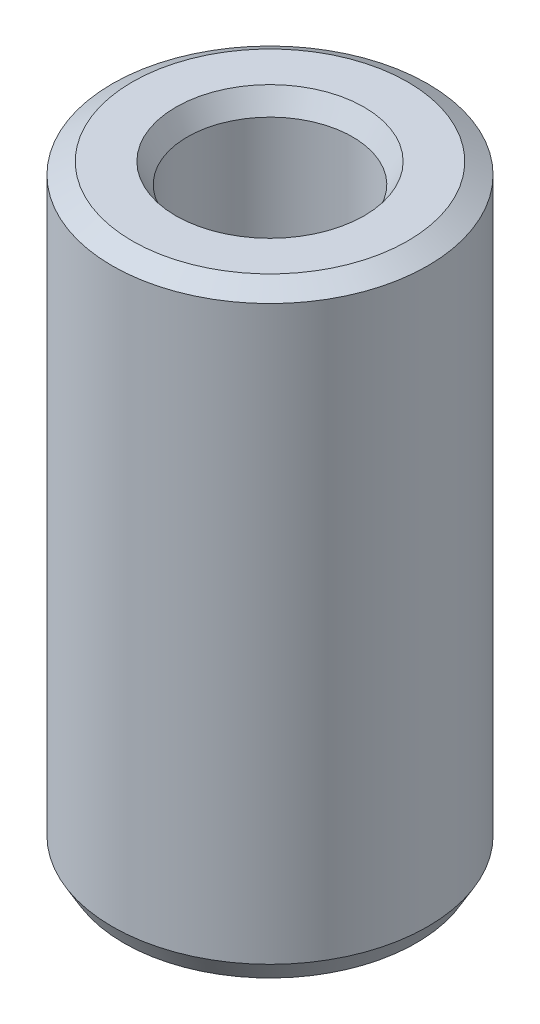
ISO-10303-21;
HEADER;
FILE_DESCRIPTION(('STEP AP214'),'2;1');
FILE_NAME('part.step','',(''),(''),'','','');
FILE_SCHEMA(('AUTOMOTIVE_DESIGN { 1 0 10303 214 1 1 1 1 }'));
ENDSEC;
DATA;
#1=APPLICATION_CONTEXT('core data for automotive mechanical design processes');
#2=APPLICATION_PROTOCOL_DEFINITION('international standard','automotive_design',2000,#1);
#3=PRODUCT_CONTEXT('',#1,'mechanical');
#4=PRODUCT('Part','Part','',(#3));
#5=PRODUCT_RELATED_PRODUCT_CATEGORY('part','',(#4));
#6=PRODUCT_DEFINITION_FORMATION('','',#4);
#7=PRODUCT_DEFINITION_CONTEXT('part definition',#1,'design');
#8=PRODUCT_DEFINITION('design','',#6,#7);
#9=PRODUCT_DEFINITION_SHAPE('','',#8);
#10=(LENGTH_UNIT() NAMED_UNIT(*) SI_UNIT(.MILLI.,.METRE.));
#11=(NAMED_UNIT(*) PLANE_ANGLE_UNIT() SI_UNIT($,.RADIAN.));
#12=(NAMED_UNIT(*) SI_UNIT($,.STERADIAN.) SOLID_ANGLE_UNIT());
#13=UNCERTAINTY_MEASURE_WITH_UNIT(LENGTH_MEASURE(1.E-05),#10,'distance_accuracy_value','');
#14=(GEOMETRIC_REPRESENTATION_CONTEXT(3) GLOBAL_UNCERTAINTY_ASSIGNED_CONTEXT((#13)) GLOBAL_UNIT_ASSIGNED_CONTEXT((#10,
#11,#12)) REPRESENTATION_CONTEXT('',''));
#15=CARTESIAN_POINT('',(0.,0.,0.));
#16=DIRECTION('',(0.,0.,1.));
#17=DIRECTION('',(1.,0.,0.));
#18=AXIS2_PLACEMENT_3D('',#15,#16,#17);
#19=CARTESIAN_POINT('',(0.,143.546503099272,0.));
#20=DIRECTION('',(0.,-1.,0.));
#21=DIRECTION('',(0.,0.,-1.));
#22=AXIS2_PLACEMENT_3D('',#19,#20,#21);
#23=CYLINDRICAL_SURFACE('',#22,37.5);
#24=CARTESIAN_POINT('',(0.,4.75413577552677,0.));
#25=DIRECTION('',(0.,1.,0.));
#26=DIRECTION('',(0.,0.,1.));
#27=AXIS2_PLACEMENT_3D('',#24,#25,#26);
#28=CIRCLE('',#27,37.5);
#29=CARTESIAN_POINT('',(0.,4.75413577552677,37.5));
#30=VERTEX_POINT('',#29);
#31=EDGE_CURVE('E10',#30,#30,#28,.T.);
#32=ORIENTED_EDGE('',*,*,#31,.T.);
#33=EDGE_LOOP('',(#32));
#34=FACE_BOUND('',#33,.T.);
#35=CARTESIAN_POINT('',(0.,140.801701529508,0.));
#36=DIRECTION('',(0.,1.,0.));
#37=DIRECTION('',(0.,0.,1.));
#38=AXIS2_PLACEMENT_3D('',#35,#36,#37);
#39=CIRCLE('',#38,37.5);
#40=CARTESIAN_POINT('',(0.,140.801701529508,-37.5));
#41=VERTEX_POINT('',#40);
#42=EDGE_CURVE('E50',#41,#41,#39,.F.);
#43=ORIENTED_EDGE('',*,*,#42,.T.);
#44=EDGE_LOOP('',(#43));
#45=FACE_BOUND('',#44,.T.);
#46=ADVANCED_FACE('F39',(#34,#45),#23,.T.);
#47=CARTESIAN_POINT('',(0.,143.546503099272,0.));
#48=DIRECTION('',(0.,1.,0.));
#49=DIRECTION('',(0.,0.,1.));
#50=AXIS2_PLACEMENT_3D('',#47,#48,#49);
#51=PLANE('',#50);
#52=CARTESIAN_POINT('',(0.,143.546503099272,0.));
#53=DIRECTION('',(0.,1.,0.));
#54=DIRECTION('',(0.,0.,1.));
#55=AXIS2_PLACEMENT_3D('',#52,#53,#54);
#56=CIRCLE('',#55,22.3829462711324);
#57=CARTESIAN_POINT('',(0.,143.546503099272,22.3829462711324));
#58=VERTEX_POINT('',#57);
#59=EDGE_CURVE('E58',#58,#58,#56,.F.);
#60=ORIENTED_EDGE('',*,*,#59,.T.);
#61=EDGE_LOOP('',(#60));
#62=FACE_BOUND('',#61,.T.);
#63=CARTESIAN_POINT('',(0.,143.546503099272,0.));
#64=DIRECTION('',(0.,1.,0.));
#65=DIRECTION('',(0.,0.,1.));
#66=AXIS2_PLACEMENT_3D('',#63,#64,#65);
#67=CIRCLE('',#66,32.7458642244732);
#68=CARTESIAN_POINT('',(0.,143.546503099272,-32.7458642244732));
#69=VERTEX_POINT('',#68);
#70=EDGE_CURVE('E61',#69,#69,#67,.T.);
#71=ORIENTED_EDGE('',*,*,#70,.T.);
#72=EDGE_LOOP('',(#71));
#73=FACE_BOUND('',#72,.T.);
#74=ADVANCED_FACE('F88',(#62,#73),#51,.T.);
#75=CARTESIAN_POINT('',(0.,0.,0.));
#76=DIRECTION('',(0.,1.,0.));
#77=DIRECTION('',(0.,0.,1.));
#78=AXIS2_PLACEMENT_3D('',#75,#76,#77);
#79=PLANE('',#78);
#80=CARTESIAN_POINT('',(0.,0.,0.));
#81=DIRECTION('',(0.,1.,0.));
#82=DIRECTION('',(0.,0.,1.));
#83=AXIS2_PLACEMENT_3D('',#80,#81,#82);
#84=CIRCLE('',#83,24.3922804768948);
#85=CARTESIAN_POINT('',(0.,0.,24.3922804768948));
#86=VERTEX_POINT('',#85);
#87=EDGE_CURVE('E51',#86,#86,#84,.T.);
#88=ORIENTED_EDGE('',*,*,#87,.T.);
#89=EDGE_LOOP('',(#88));
#90=FACE_BOUND('',#89,.T.);
#91=CARTESIAN_POINT('',(0.,0.,0.));
#92=DIRECTION('',(0.,1.,0.));
#93=DIRECTION('',(0.,0.,1.));
#94=AXIS2_PLACEMENT_3D('',#91,#92,#93);
#95=CIRCLE('',#94,34.7551984302356);
#96=CARTESIAN_POINT('',(0.,0.,34.7551984302356));
#97=VERTEX_POINT('',#96);
#98=EDGE_CURVE('E54',#97,#97,#95,.F.);
#99=ORIENTED_EDGE('',*,*,#98,.T.);
#100=EDGE_LOOP('',(#99));
#101=FACE_BOUND('',#100,.T.);
#102=ADVANCED_FACE('F83',(#90,#101),#79,.F.);
#103=CARTESIAN_POINT('',(0.,143.546503099272,0.));
#104=DIRECTION('',(0.,-1.,0.));
#105=DIRECTION('',(0.,0.,-1.));
#106=AXIS2_PLACEMENT_3D('',#103,#104,#105);
#107=CYLINDRICAL_SURFACE('',#106,19.638144701368);
#108=CARTESIAN_POINT('',(0.,138.792367323745,0.));
#109=DIRECTION('',(0.,1.,0.));
#110=DIRECTION('',(0.,0.,1.));
#111=AXIS2_PLACEMENT_3D('',#108,#109,#110);
#112=CIRCLE('',#111,19.638144701368);
#113=CARTESIAN_POINT('',(0.,138.792367323745,19.638144701368));
#114=VERTEX_POINT('',#113);
#115=EDGE_CURVE('E67',#114,#114,#112,.T.);
#116=ORIENTED_EDGE('',*,*,#115,.T.);
#117=EDGE_LOOP('',(#116));
#118=FACE_BOUND('',#117,.T.);
#119=CARTESIAN_POINT('',(0.,2.74480156976448,0.));
#120=DIRECTION('',(0.,1.,0.));
#121=DIRECTION('',(0.,0.,1.));
#122=AXIS2_PLACEMENT_3D('',#119,#120,#121);
#123=CIRCLE('',#122,19.638144701368);
#124=CARTESIAN_POINT('',(0.,2.74480156976448,19.638144701368));
#125=VERTEX_POINT('',#124);
#126=EDGE_CURVE('E69',#125,#125,#123,.F.);
#127=ORIENTED_EDGE('',*,*,#126,.T.);
#128=EDGE_LOOP('',(#127));
#129=FACE_BOUND('',#128,.T.);
#130=ADVANCED_FACE('F71',(#118,#129),#107,.F.);
#131=CARTESIAN_POINT('',(0.,138.792367323745,0.));
#132=DIRECTION('',(0.,1.,0.));
#133=DIRECTION('',(0.,0.,1.));
#134=AXIS2_PLACEMENT_3D('',#131,#132,#133);
#135=CONICAL_SURFACE('',#134,19.638144701368,0.523598775598302);
#136=ORIENTED_EDGE('',*,*,#59,.F.);
#137=EDGE_LOOP('',(#136));
#138=FACE_BOUND('',#137,.T.);
#139=ORIENTED_EDGE('',*,*,#115,.F.);
#140=EDGE_LOOP('',(#139));
#141=FACE_BOUND('',#140,.T.);
#142=ADVANCED_FACE('F77',(#138,#141),#135,.F.);
#143=CARTESIAN_POINT('',(0.,0.,0.));
#144=DIRECTION('',(0.,-1.,0.));
#145=DIRECTION('',(0.,0.,-1.));
#146=AXIS2_PLACEMENT_3D('',#143,#144,#145);
#147=CONICAL_SURFACE('',#146,24.3922804768948,1.04719755119659);
#148=ORIENTED_EDGE('',*,*,#126,.F.);
#149=EDGE_LOOP('',(#148));
#150=FACE_BOUND('',#149,.T.);
#151=ORIENTED_EDGE('',*,*,#87,.F.);
#152=EDGE_LOOP('',(#151));
#153=FACE_BOUND('',#152,.T.);
#154=ADVANCED_FACE('F73',(#150,#153),#147,.F.);
#155=CARTESIAN_POINT('',(0.,4.75413577552677,0.));
#156=DIRECTION('',(0.,1.,0.));
#157=DIRECTION('',(0.,0.,1.));
#158=AXIS2_PLACEMENT_3D('',#155,#156,#157);
#159=CONICAL_SURFACE('',#158,37.5,0.523598775598303);
#160=ORIENTED_EDGE('',*,*,#98,.F.);
#161=EDGE_LOOP('',(#160));
#162=FACE_BOUND('',#161,.T.);
#163=ORIENTED_EDGE('',*,*,#31,.F.);
#164=EDGE_LOOP('',(#163));
#165=FACE_BOUND('',#164,.T.);
#166=ADVANCED_FACE('F76',(#162,#165),#159,.T.);
#167=CARTESIAN_POINT('',(0.,143.546503099272,0.));
#168=DIRECTION('',(0.,-1.,0.));
#169=DIRECTION('',(0.,0.,-1.));
#170=AXIS2_PLACEMENT_3D('',#167,#168,#169);
#171=CONICAL_SURFACE('',#170,32.7458642244732,1.0471975511966);
#172=CARTESIAN_POINT('',(0.,140.801701529508,-37.5));
#173=CARTESIAN_POINT('',(0.,140.830293212526,-37.4504777523383));
#174=CARTESIAN_POINT('',(0.,140.858884895544,-37.4009555046766));
#175=CARTESIAN_POINT('',(0.,140.916068261581,-37.3019110093531));
#176=CARTESIAN_POINT('',(0.,140.944659944599,-37.2523887616913));
#177=CARTESIAN_POINT('',(0.,141.001843310636,-37.1533442663679));
#178=CARTESIAN_POINT('',(0.,141.030434993655,-37.1038220187061));
#179=CARTESIAN_POINT('',(0.,141.087618359691,-37.0047775233826));
#180=CARTESIAN_POINT('',(0.,141.11621004271,-36.9552552757209));
#181=CARTESIAN_POINT('',(0.,141.173393408746,-36.8562107803974));
#182=CARTESIAN_POINT('',(0.,141.201985091765,-36.8066885327357));
#183=CARTESIAN_POINT('',(0.,141.259168457802,-36.7076440374122));
#184=CARTESIAN_POINT('',(0.,141.28776014082,-36.6581217897505));
#185=CARTESIAN_POINT('',(0.,141.344943506857,-36.559077294427));
#186=CARTESIAN_POINT('',(0.,141.373535189875,-36.5095550467653));
#187=CARTESIAN_POINT('',(0.,141.430718555912,-36.4105105514418));
#188=CARTESIAN_POINT('',(0.,141.45931023893,-36.3609883037801));
#189=CARTESIAN_POINT('',(0.,141.516493604967,-36.2619438084566));
#190=CARTESIAN_POINT('',(0.,141.545085287985,-36.2124215607949));
#191=CARTESIAN_POINT('',(0.,141.602268654022,-36.1133770654714));
#192=CARTESIAN_POINT('',(0.,141.630860337041,-36.0638548178096));
#193=CARTESIAN_POINT('',(0.,141.688043703077,-35.9648103224862));
#194=CARTESIAN_POINT('',(0.,141.716635386096,-35.9152880748244));
#195=CARTESIAN_POINT('',(0.,141.773818752132,-35.8162435795009));
#196=CARTESIAN_POINT('',(0.,141.802410435151,-35.7667213318392));
#197=CARTESIAN_POINT('',(0.,141.859593801188,-35.6676768365157));
#198=CARTESIAN_POINT('',(0.,141.888185484206,-35.618154588854));
#199=CARTESIAN_POINT('',(0.,141.945368850243,-35.5191100935305));
#200=CARTESIAN_POINT('',(0.,141.973960533261,-35.4695878458688));
#201=CARTESIAN_POINT('',(0.,142.031143899298,-35.3705433505453));
#202=CARTESIAN_POINT('',(0.,142.059735582316,-35.3210211028836));
#203=CARTESIAN_POINT('',(0.,142.116918948353,-35.2219766075601));
#204=CARTESIAN_POINT('',(0.,142.145510631371,-35.1724543598984));
#205=CARTESIAN_POINT('',(0.,142.202693997408,-35.0734098645749));
#206=CARTESIAN_POINT('',(0.,142.231285680426,-35.0238876169131));
#207=CARTESIAN_POINT('',(0.,142.288469046463,-34.9248431215897));
#208=CARTESIAN_POINT('',(0.,142.317060729482,-34.8753208739279));
#209=CARTESIAN_POINT('',(0.,142.374244095518,-34.7762763786045));
#210=CARTESIAN_POINT('',(0.,142.402835778537,-34.7267541309427));
#211=CARTESIAN_POINT('',(0.,142.460019144574,-34.6277096356192));
#212=CARTESIAN_POINT('',(0.,142.488610827592,-34.5781873879575));
#213=CARTESIAN_POINT('',(0.,142.545794193629,-34.479142892634));
#214=CARTESIAN_POINT('',(0.,142.574385876647,-34.4296206449723));
#215=CARTESIAN_POINT('',(0.,142.631569242684,-34.3305761496488));
#216=CARTESIAN_POINT('',(0.,142.660160925702,-34.2810539019871));
#217=CARTESIAN_POINT('',(0.,142.717344291739,-34.1820094066636));
#218=CARTESIAN_POINT('',(0.,142.745935974757,-34.1324871590019));
#219=CARTESIAN_POINT('',(0.,142.803119340794,-34.0334426636784));
#220=CARTESIAN_POINT('',(0.,142.831711023812,-33.9839204160166));
#221=CARTESIAN_POINT('',(0.,142.888894389849,-33.8848759206932));
#222=CARTESIAN_POINT('',(0.,142.917486072868,-33.8353536730314));
#223=CARTESIAN_POINT('',(0.,142.974669438904,-33.736309177708));
#224=CARTESIAN_POINT('',(0.,143.003261121923,-33.6867869300462));
#225=CARTESIAN_POINT('',(0.,143.06044448796,-33.5877424347227));
#226=CARTESIAN_POINT('',(0.,143.089036170978,-33.538220187061));
#227=CARTESIAN_POINT('',(0.,143.146219537015,-33.4391756917375));
#228=CARTESIAN_POINT('',(0.,143.174811220033,-33.3896534440758));
#229=CARTESIAN_POINT('',(0.,143.23199458607,-33.2906089487523));
#230=CARTESIAN_POINT('',(0.,143.260586269088,-33.2410867010906));
#231=CARTESIAN_POINT('',(0.,143.317769635125,-33.1420422057671));
#232=CARTESIAN_POINT('',(0.,143.346361318143,-33.0925199581054));
#233=CARTESIAN_POINT('',(0.,143.40354468418,-32.9934754627819));
#234=CARTESIAN_POINT('',(0.,143.432136367198,-32.9439532151201));
#235=CARTESIAN_POINT('',(0.,143.489319733235,-32.8449087197967));
#236=CARTESIAN_POINT('',(0.,143.517911416254,-32.7953864721349));
#237=CARTESIAN_POINT('',(0.,143.546503099272,-32.7458642244732));
#238=B_SPLINE_CURVE_WITH_KNOTS('',3,(#172,#173,#174,#175,#176,#177,#178,#179,#180,#181,#182,
#183,#184,#185,#186,#187,#188,#189,#190,#191,#192,#193,#194,#195,#196,#197,#198,#199,#200,#201,
#202,#203,#204,#205,#206,#207,#208,#209,#210,#211,#212,#213,#214,#215,#216,#217,#218,#219,#220,
#221,#222,#223,#224,#225,#226,#227,#228,#229,#230,#231,#232,#233,#234,#235,#236,#237),
.UNSPECIFIED.,.F.,.F.,(4,2,2,2,2,2,2,2,2,2,2,2,2,2,2,2,2,2,2,2,2,2,2,2,2,2,2,2,2,2,2,2,4),(0.,
0.171550098110278,0.343100196220549,0.514650294330827,0.686200392441113,0.857750490551385,
1.02930058866166,1.20085068677193,1.37240078488223,1.5439508829925,1.71550098110277,
1.88705107921306,2.05860117732333,2.2301512754336,2.40170137354388,2.57325147165417,
2.74480156976444,2.91635166787472,3.087901765985,3.25945186409528,3.43100196220555,
3.60255206031582,3.77410215842611,3.94565225653639,4.11720235464666,4.28875245275695,
4.46030255086722,4.6318526489775,4.80340274708777,4.97495284519806,5.14650294330834,
5.31805304141861,5.4896031395289),.UNSPECIFIED.);
#239=EDGE_CURVE('BSEAM45',#41,#69,#238,.T.);
#240=ORIENTED_EDGE('',*,*,#42,.F.);
#241=ORIENTED_EDGE('',*,*,#70,.F.);
#242=ORIENTED_EDGE('',*,*,#239,.T.);
#243=ORIENTED_EDGE('',*,*,#239,.F.);
#244=EDGE_LOOP('',(#240,#242,#241,#243));
#245=FACE_BOUND('',#244,.T.);
#246=ADVANCED_FACE('F45',(#245),#171,.T.);
#247=CLOSED_SHELL('',(#46,#74,#102,#130,#142,#154,#166,#246));
#248=MANIFOLD_SOLID_BREP('B2',#247);
#249=ADVANCED_BREP_SHAPE_REPRESENTATION('',(#18,#248),#14);
#250=SHAPE_DEFINITION_REPRESENTATION(#9,#249);
ENDSEC;
END-ISO-10303-21;
